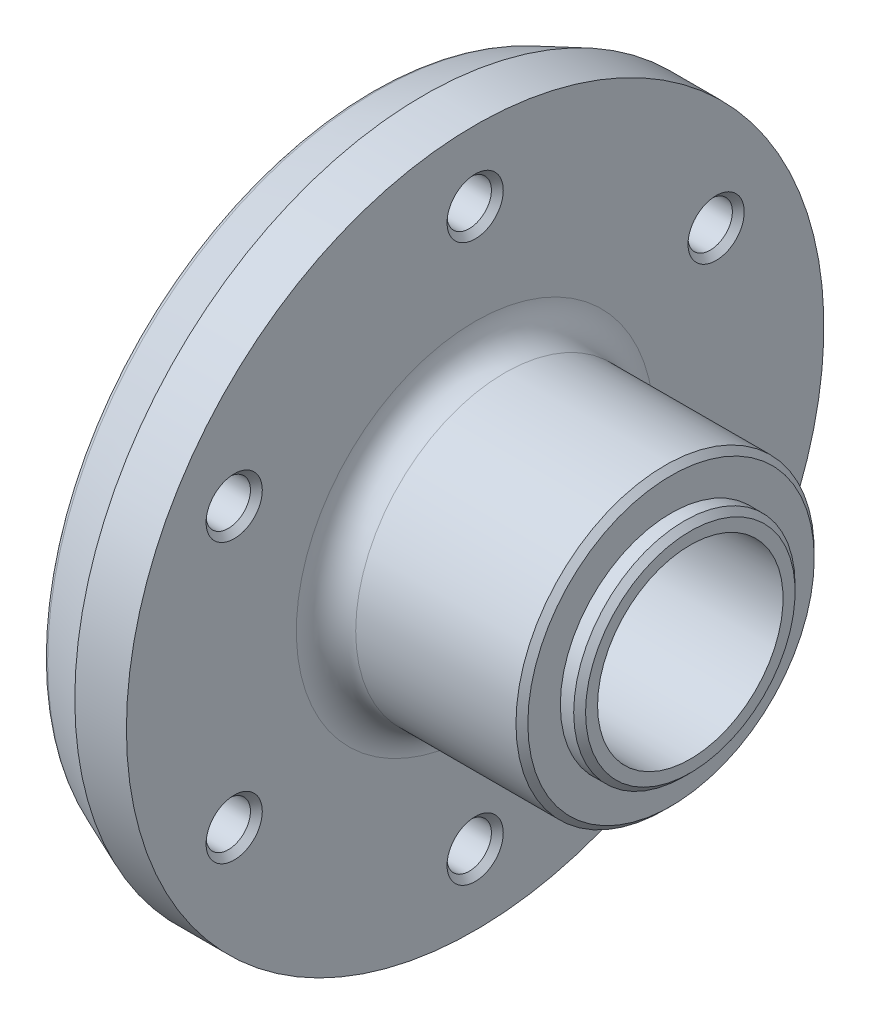
ISO-10303-21;
HEADER;
FILE_DESCRIPTION(('STEP AP214'),'2;1');
FILE_NAME('part.step','',(''),(''),'','','');
FILE_SCHEMA(('AUTOMOTIVE_DESIGN { 1 0 10303 214 1 1 1 1 }'));
ENDSEC;
DATA;
#1=APPLICATION_CONTEXT('core data for automotive mechanical design processes');
#2=APPLICATION_PROTOCOL_DEFINITION('international standard','automotive_design',2000,#1);
#3=PRODUCT_CONTEXT('',#1,'mechanical');
#4=PRODUCT('Part','Part','',(#3));
#5=PRODUCT_RELATED_PRODUCT_CATEGORY('part','',(#4));
#6=PRODUCT_DEFINITION_FORMATION('','',#4);
#7=PRODUCT_DEFINITION_CONTEXT('part definition',#1,'design');
#8=PRODUCT_DEFINITION('design','',#6,#7);
#9=PRODUCT_DEFINITION_SHAPE('','',#8);
#10=(LENGTH_UNIT() NAMED_UNIT(*) SI_UNIT(.MILLI.,.METRE.));
#11=(NAMED_UNIT(*) PLANE_ANGLE_UNIT() SI_UNIT($,.RADIAN.));
#12=(NAMED_UNIT(*) SI_UNIT($,.STERADIAN.) SOLID_ANGLE_UNIT());
#13=UNCERTAINTY_MEASURE_WITH_UNIT(LENGTH_MEASURE(1.E-05),#10,'distance_accuracy_value','');
#14=(GEOMETRIC_REPRESENTATION_CONTEXT(3) GLOBAL_UNCERTAINTY_ASSIGNED_CONTEXT((#13)) GLOBAL_UNIT_ASSIGNED_CONTEXT((#10,
#11,#12)) REPRESENTATION_CONTEXT('',''));
#15=CARTESIAN_POINT('',(0.,0.,0.));
#16=DIRECTION('',(0.,0.,1.));
#17=DIRECTION('',(1.,0.,0.));
#18=AXIS2_PLACEMENT_3D('',#15,#16,#17);
#19=CARTESIAN_POINT('',(78.54696,-23.8125,0.));
#20=DIRECTION('',(-1.,0.,0.));
#21=DIRECTION('',(0.,0.,1.));
#22=AXIS2_PLACEMENT_3D('',#19,#20,#21);
#23=CYLINDRICAL_SURFACE('',#22,2.413);
#24=CARTESIAN_POINT('',(46.863,-23.8125,0.));
#25=DIRECTION('',(-1.,0.,0.));
#26=DIRECTION('',(0.,0.,1.));
#27=AXIS2_PLACEMENT_3D('',#24,#25,#26);
#28=CIRCLE('',#27,2.413);
#29=CARTESIAN_POINT('',(46.863,-23.8125,2.413));
#30=VERTEX_POINT('',#29);
#31=EDGE_CURVE('P0_E10',#30,#30,#28,.F.);
#32=ORIENTED_EDGE('',*,*,#31,.T.);
#33=EDGE_LOOP('',(#32));
#34=FACE_BOUND('',#33,.T.);
#35=CARTESIAN_POINT('',(55.88,-23.8125,0.));
#36=DIRECTION('',(-1.,0.,0.));
#37=DIRECTION('',(0.,0.,1.));
#38=AXIS2_PLACEMENT_3D('',#35,#36,#37);
#39=CIRCLE('',#38,2.413);
#40=CARTESIAN_POINT('',(55.88,-23.8125,2.413));
#41=VERTEX_POINT('',#40);
#42=EDGE_CURVE('P0_E15',#41,#41,#39,.T.);
#43=ORIENTED_EDGE('',*,*,#42,.T.);
#44=EDGE_LOOP('',(#43));
#45=FACE_BOUND('',#44,.T.);
#46=ADVANCED_FACE('P0_F14',(#34,#45),#23,.T.);
#47=OPEN_SHELL('',(#46));
#48=SHELL_BASED_SURFACE_MODEL('P0_B1',(#47));
#49=CARTESIAN_POINT('',(72.1360000003251,0.,0.));
#50=DIRECTION('',(-1.,0.,0.));
#51=DIRECTION('',(0.,0.,1.));
#52=AXIS2_PLACEMENT_3D('',#49,#50,#51);
#53=CONICAL_SURFACE('',#52,12.7634999996748,0.785398163397302);
#54=CARTESIAN_POINT('',(72.644,0.,0.));
#55=DIRECTION('',(-1.,0.,0.));
#56=DIRECTION('',(0.,0.,1.));
#57=AXIS2_PLACEMENT_3D('',#54,#55,#56);
#58=CIRCLE('',#57,12.2555);
#59=CARTESIAN_POINT('',(72.644,0.,12.2555));
#60=VERTEX_POINT('',#59);
#61=EDGE_CURVE('P1_E107',#60,#60,#58,.T.);
#62=ORIENTED_EDGE('',*,*,#61,.T.);
#63=EDGE_LOOP('',(#62));
#64=FACE_BOUND('',#63,.T.);
#65=CARTESIAN_POINT('',(72.1360000003302,0.,0.));
#66=DIRECTION('',(-1.,0.,0.));
#67=DIRECTION('',(0.,0.,1.));
#68=AXIS2_PLACEMENT_3D('',#65,#66,#67);
#69=CIRCLE('',#68,12.7635);
#70=CARTESIAN_POINT('',(72.1360000003302,0.,12.7635));
#71=VERTEX_POINT('',#70);
#72=EDGE_CURVE('P1_E108',#71,#71,#69,.T.);
#73=ORIENTED_EDGE('',*,*,#72,.F.);
#74=EDGE_LOOP('',(#73));
#75=FACE_BOUND('',#74,.T.);
#76=ADVANCED_FACE('P1_F16',(#64,#75),#53,.T.);
#77=CARTESIAN_POINT('',(75.6666,0.,0.));
#78=DIRECTION('',(-1.,0.,0.));
#79=DIRECTION('',(0.,0.,1.));
#80=AXIS2_PLACEMENT_3D('',#77,#78,#79);
#81=CYLINDRICAL_SURFACE('',#80,12.7635);
#82=CARTESIAN_POINT('',(58.42,0.,0.));
#83=DIRECTION('',(-1.,0.,0.));
#84=DIRECTION('',(0.,-0.99988463643586,0.0151892665895294));
#85=AXIS2_PLACEMENT_3D('',#82,#83,#84);
#86=CIRCLE('',#85,12.7635);
#87=CARTESIAN_POINT('',(58.42,-12.7620275571491,0.193868204115458));
#88=VERTEX_POINT('',#87);
#89=EDGE_CURVE('P1_E99',#88,#88,#86,.F.);
#90=ORIENTED_EDGE('',*,*,#89,.T.);
#91=EDGE_LOOP('',(#90));
#92=FACE_BOUND('',#91,.T.);
#93=ORIENTED_EDGE('',*,*,#72,.T.);
#94=EDGE_LOOP('',(#93));
#95=FACE_BOUND('',#94,.T.);
#96=ADVANCED_FACE('P1_F597',(#92,#95),#81,.T.);
#97=CARTESIAN_POINT('',(72.644,0.,0.));
#98=DIRECTION('',(-1.,0.,0.));
#99=DIRECTION('',(0.,0.,1.));
#100=AXIS2_PLACEMENT_3D('',#97,#98,#99);
#101=PLANE('',#100);
#102=CARTESIAN_POINT('',(72.644,0.,0.));
#103=DIRECTION('',(-1.,0.,0.));
#104=DIRECTION('',(0.,0.,1.));
#105=AXIS2_PLACEMENT_3D('',#102,#103,#104);
#106=CIRCLE('',#105,9.4742);
#107=CARTESIAN_POINT('',(72.644,0.,9.4742));
#108=VERTEX_POINT('',#107);
#109=EDGE_CURVE('P1_E56',#108,#108,#106,.F.);
#110=ORIENTED_EDGE('',*,*,#109,.F.);
#111=EDGE_LOOP('',(#110));
#112=FACE_BOUND('',#111,.T.);
#113=ORIENTED_EDGE('',*,*,#61,.F.);
#114=EDGE_LOOP('',(#113));
#115=FACE_BOUND('',#114,.T.);
#116=ADVANCED_FACE('P1_F91',(#112,#115),#101,.F.);
#117=CARTESIAN_POINT('',(58.42,0.,0.));
#118=DIRECTION('',(-1.,0.,0.));
#119=DIRECTION('',(0.,-0.99988463643586,0.0151892665895294));
#120=AXIS2_PLACEMENT_3D('',#117,#118,#119);
#121=TOROIDAL_SURFACE('',#120,15.3035,2.54);
#122=ORIENTED_EDGE('',*,*,#89,.F.);
#123=EDGE_LOOP('',(#122));
#124=FACE_BOUND('',#123,.T.);
#125=CARTESIAN_POINT('',(55.88,0.,0.));
#126=DIRECTION('',(1.,0.,0.));
#127=DIRECTION('',(0.,1.,0.));
#128=AXIS2_PLACEMENT_3D('',#125,#126,#127);
#129=CIRCLE('',#128,15.3035);
#130=CARTESIAN_POINT('',(55.88,15.3035,0.));
#131=VERTEX_POINT('',#130);
#132=CARTESIAN_POINT('',(55.88,-15.3035,0.));
#133=VERTEX_POINT('',#132);
#134=EDGE_CURVE('P1_E51',#131,#133,#129,.T.);
#135=ORIENTED_EDGE('',*,*,#134,.T.);
#136=CARTESIAN_POINT('',(55.88,0.,0.));
#137=DIRECTION('',(1.,0.,0.));
#138=DIRECTION('',(0.,-1.,0.));
#139=AXIS2_PLACEMENT_3D('',#136,#137,#138);
#140=CIRCLE('',#139,15.3035);
#141=EDGE_CURVE('P1_E48',#133,#131,#140,.T.);
#142=ORIENTED_EDGE('',*,*,#141,.T.);
#143=EDGE_LOOP('',(#135,#142));
#144=FACE_BOUND('',#143,.T.);
#145=ADVANCED_FACE('P1_F52',(#124,#144),#121,.F.);
#146=CARTESIAN_POINT('',(75.6666,0.,0.));
#147=DIRECTION('',(-1.,0.,0.));
#148=DIRECTION('',(0.,0.,1.));
#149=AXIS2_PLACEMENT_3D('',#146,#147,#148);
#150=CYLINDRICAL_SURFACE('',#149,9.4742);
#151=ORIENTED_EDGE('',*,*,#109,.T.);
#152=EDGE_LOOP('',(#151));
#153=FACE_BOUND('',#152,.T.);
#154=CARTESIAN_POINT('',(73.7869999999949,0.,0.));
#155=DIRECTION('',(-1.,0.,0.));
#156=DIRECTION('',(0.,0.,-1.));
#157=AXIS2_PLACEMENT_3D('',#154,#155,#156);
#158=CIRCLE('',#157,9.47419999999489);
#159=CARTESIAN_POINT('',(73.7869999999949,0.,-9.47419999999489));
#160=VERTEX_POINT('',#159);
#161=EDGE_CURVE('P1_E62',#160,#160,#158,.F.);
#162=ORIENTED_EDGE('',*,*,#161,.F.);
#163=EDGE_LOOP('',(#162));
#164=FACE_BOUND('',#163,.T.);
#165=ADVANCED_FACE('P1_F82',(#153,#164),#150,.T.);
#166=CARTESIAN_POINT('',(55.88,0.,0.));
#167=DIRECTION('',(-1.,0.,0.));
#168=DIRECTION('',(0.,0.,1.));
#169=AXIS2_PLACEMENT_3D('',#166,#167,#168);
#170=PLANE('',#169);
#171=CARTESIAN_POINT('',(55.8799999999451,-11.90625,20.6222299276167));
#172=DIRECTION('',(1.,0.,0.));
#173=DIRECTION('',(0.,0.,-1.));
#174=AXIS2_PLACEMENT_3D('',#171,#172,#173);
#175=CIRCLE('',#174,2.4066499999751);
#176=CARTESIAN_POINT('',(55.8799999999451,-11.90625,18.2155799276416));
#177=VERTEX_POINT('',#176);
#178=EDGE_CURVE('P1_E155',#177,#177,#175,.F.);
#179=ORIENTED_EDGE('',*,*,#178,.T.);
#180=EDGE_LOOP('',(#179));
#181=FACE_BOUND('',#180,.T.);
#182=CARTESIAN_POINT('',(55.8799999999451,11.90625,20.6222299276167));
#183=DIRECTION('',(1.,0.,0.));
#184=DIRECTION('',(0.,0.,-1.));
#185=AXIS2_PLACEMENT_3D('',#182,#183,#184);
#186=CIRCLE('',#185,2.4066499999751);
#187=CARTESIAN_POINT('',(55.8799999999451,11.90625,18.2155799276416));
#188=VERTEX_POINT('',#187);
#189=EDGE_CURVE('P1_E152',#188,#188,#186,.F.);
#190=ORIENTED_EDGE('',*,*,#189,.T.);
#191=EDGE_LOOP('',(#190));
#192=FACE_BOUND('',#191,.T.);
#193=CARTESIAN_POINT('',(55.8800000000019,23.8125,0.));
#194=DIRECTION('',(1.,0.,0.));
#195=DIRECTION('',(0.,0.,-1.));
#196=AXIS2_PLACEMENT_3D('',#193,#194,#195);
#197=CIRCLE('',#196,2.40664999995488);
#198=CARTESIAN_POINT('',(55.8800000000019,23.8125,-2.40664999995488));
#199=VERTEX_POINT('',#198);
#200=EDGE_CURVE('P1_E148',#199,#199,#197,.F.);
#201=ORIENTED_EDGE('',*,*,#200,.T.);
#202=EDGE_LOOP('',(#201));
#203=FACE_BOUND('',#202,.T.);
#204=CARTESIAN_POINT('',(55.8799999999451,11.90625,-20.6222299276167));
#205=DIRECTION('',(1.,0.,0.));
#206=DIRECTION('',(0.,0.,-1.));
#207=AXIS2_PLACEMENT_3D('',#204,#205,#206);
#208=CIRCLE('',#207,2.4066499999915);
#209=CARTESIAN_POINT('',(55.8799999999451,11.90625,-23.0288799276082));
#210=VERTEX_POINT('',#209);
#211=EDGE_CURVE('P1_E145',#210,#210,#208,.F.);
#212=ORIENTED_EDGE('',*,*,#211,.T.);
#213=EDGE_LOOP('',(#212));
#214=FACE_BOUND('',#213,.T.);
#215=CARTESIAN_POINT('',(55.8799999999451,-11.90625,-20.6222299276167));
#216=DIRECTION('',(1.,0.,0.));
#217=DIRECTION('',(0.,0.,-1.));
#218=AXIS2_PLACEMENT_3D('',#215,#216,#217);
#219=CIRCLE('',#218,2.4066499999915);
#220=CARTESIAN_POINT('',(55.8799999999451,-11.90625,-23.0288799276082));
#221=VERTEX_POINT('',#220);
#222=EDGE_CURVE('P1_E142',#221,#221,#219,.F.);
#223=ORIENTED_EDGE('',*,*,#222,.T.);
#224=EDGE_LOOP('',(#223));
#225=FACE_BOUND('',#224,.T.);
#226=CARTESIAN_POINT('',(55.8800000000019,-23.8125,0.));
#227=DIRECTION('',(1.,0.,0.));
#228=DIRECTION('',(0.,0.,-1.));
#229=AXIS2_PLACEMENT_3D('',#226,#227,#228);
#230=CIRCLE('',#229,2.40664999995488);
#231=CARTESIAN_POINT('',(55.8800000000019,-23.8125,-2.40664999995488));
#232=VERTEX_POINT('',#231);
#233=EDGE_CURVE('P1_E139',#232,#232,#230,.F.);
#234=ORIENTED_EDGE('',*,*,#233,.T.);
#235=EDGE_LOOP('',(#234));
#236=FACE_BOUND('',#235,.T.);
#237=ORIENTED_EDGE('',*,*,#134,.F.);
#238=ORIENTED_EDGE('',*,*,#141,.F.);
#239=EDGE_LOOP('',(#237,#238));
#240=FACE_BOUND('',#239,.T.);
#241=CARTESIAN_POINT('',(55.88,0.,0.));
#242=DIRECTION('',(-1.,0.,0.));
#243=DIRECTION('',(0.,0.,1.));
#244=AXIS2_PLACEMENT_3D('',#241,#242,#243);
#245=CIRCLE('',#244,29.845);
#246=CARTESIAN_POINT('',(55.88,0.,29.845));
#247=VERTEX_POINT('',#246);
#248=EDGE_CURVE('P1_E158',#247,#247,#245,.T.);
#249=ORIENTED_EDGE('',*,*,#248,.F.);
#250=EDGE_LOOP('',(#249));
#251=FACE_BOUND('',#250,.T.);
#252=ADVANCED_FACE('P1_F59',(#181,#192,#203,#214,#225,#236,#240,#251),#170,.F.);
#253=CARTESIAN_POINT('',(73.7869999999949,0.,0.));
#254=DIRECTION('',(-1.,0.,0.));
#255=DIRECTION('',(0.,0.,1.));
#256=AXIS2_PLACEMENT_3D('',#253,#254,#255);
#257=CONICAL_SURFACE('',#256,9.47419999999488,0.785398163397298);
#258=CARTESIAN_POINT('',(74.2949999999949,0.,0.));
#259=DIRECTION('',(-1.,0.,0.));
#260=DIRECTION('',(0.,0.,1.));
#261=AXIS2_PLACEMENT_3D('',#258,#259,#260);
#262=CIRCLE('',#261,8.96619999999497);
#263=CARTESIAN_POINT('',(74.2949999999949,0.,8.96619999999497));
#264=VERTEX_POINT('',#263);
#265=EDGE_CURVE('P1_E135',#264,#264,#262,.T.);
#266=ORIENTED_EDGE('',*,*,#265,.T.);
#267=EDGE_LOOP('',(#266));
#268=FACE_BOUND('',#267,.T.);
#269=ORIENTED_EDGE('',*,*,#161,.T.);
#270=EDGE_LOOP('',(#269));
#271=FACE_BOUND('',#270,.T.);
#272=ADVANCED_FACE('P1_F81',(#268,#271),#257,.T.);
#273=CARTESIAN_POINT('',(75.6666,0.,0.));
#274=DIRECTION('',(-1.,0.,0.));
#275=DIRECTION('',(0.,0.,1.));
#276=AXIS2_PLACEMENT_3D('',#273,#274,#275);
#277=CYLINDRICAL_SURFACE('',#276,29.845);
#278=ORIENTED_EDGE('',*,*,#248,.T.);
#279=EDGE_LOOP('',(#278));
#280=FACE_BOUND('',#279,.T.);
#281=CARTESIAN_POINT('',(51.4620768363209,0.,0.));
#282=DIRECTION('',(1.,0.,0.));
#283=DIRECTION('',(0.,-1.,0.));
#284=AXIS2_PLACEMENT_3D('',#281,#282,#283);
#285=CIRCLE('',#284,29.8450000000007);
#286=CARTESIAN_POINT('',(51.4620768363209,-29.8450000000007,0.));
#287=VERTEX_POINT('',#286);
#288=EDGE_CURVE('P1_E138',#287,#287,#285,.F.);
#289=ORIENTED_EDGE('',*,*,#288,.F.);
#290=EDGE_LOOP('',(#289));
#291=FACE_BOUND('',#290,.T.);
#292=ADVANCED_FACE('P1_F256',(#280,#291),#277,.T.);
#293=CARTESIAN_POINT('',(55.8799999999451,-11.90625,20.6222299276167));
#294=DIRECTION('',(1.,0.,0.));
#295=DIRECTION('',(0.,0.,-1.));
#296=AXIS2_PLACEMENT_3D('',#293,#294,#295);
#297=CONICAL_SURFACE('',#296,2.4066499999751,0.785398163397448);
#298=CARTESIAN_POINT('',(55.372,-11.90625,20.6222299276167));
#299=DIRECTION('',(-1.,0.,0.));
#300=DIRECTION('',(0.,0.,1.));
#301=AXIS2_PLACEMENT_3D('',#298,#299,#300);
#302=CIRCLE('',#301,1.89865);
#303=CARTESIAN_POINT('',(55.372,-11.90625,22.5208799276167));
#304=VERTEX_POINT('',#303);
#305=EDGE_CURVE('P1_E244',#304,#304,#302,.T.);
#306=ORIENTED_EDGE('',*,*,#305,.T.);
#307=EDGE_LOOP('',(#306));
#308=FACE_BOUND('',#307,.T.);
#309=ORIENTED_EDGE('',*,*,#178,.F.);
#310=EDGE_LOOP('',(#309));
#311=FACE_BOUND('',#310,.T.);
#312=ADVANCED_FACE('P1_F258',(#308,#311),#297,.F.);
#313=CARTESIAN_POINT('',(55.8799999999451,11.90625,20.6222299276167));
#314=DIRECTION('',(1.,0.,0.));
#315=DIRECTION('',(0.,0.,-1.));
#316=AXIS2_PLACEMENT_3D('',#313,#314,#315);
#317=CONICAL_SURFACE('',#316,2.4066499999751,0.785398163397448);
#318=CARTESIAN_POINT('',(55.372,11.90625,20.6222299276167));
#319=DIRECTION('',(-1.,0.,0.));
#320=DIRECTION('',(0.,0.,1.));
#321=AXIS2_PLACEMENT_3D('',#318,#319,#320);
#322=CIRCLE('',#321,1.89865);
#323=CARTESIAN_POINT('',(55.372,11.90625,22.5208799276167));
#324=VERTEX_POINT('',#323);
#325=EDGE_CURVE('P1_E241',#324,#324,#322,.T.);
#326=ORIENTED_EDGE('',*,*,#325,.T.);
#327=EDGE_LOOP('',(#326));
#328=FACE_BOUND('',#327,.T.);
#329=ORIENTED_EDGE('',*,*,#189,.F.);
#330=EDGE_LOOP('',(#329));
#331=FACE_BOUND('',#330,.T.);
#332=ADVANCED_FACE('P1_F265',(#328,#331),#317,.F.);
#333=CARTESIAN_POINT('',(55.8800000000019,23.8125,0.));
#334=DIRECTION('',(1.,0.,0.));
#335=DIRECTION('',(0.,0.,-1.));
#336=AXIS2_PLACEMENT_3D('',#333,#334,#335);
#337=CONICAL_SURFACE('',#336,2.40664999995488,0.785398163397448);
#338=CARTESIAN_POINT('',(55.372,23.8125,0.));
#339=DIRECTION('',(-1.,0.,0.));
#340=DIRECTION('',(0.,0.,1.));
#341=AXIS2_PLACEMENT_3D('',#338,#339,#340);
#342=CIRCLE('',#341,1.89865);
#343=CARTESIAN_POINT('',(55.372,23.8125,1.89865));
#344=VERTEX_POINT('',#343);
#345=EDGE_CURVE('P1_E237',#344,#344,#342,.T.);
#346=ORIENTED_EDGE('',*,*,#345,.T.);
#347=EDGE_LOOP('',(#346));
#348=FACE_BOUND('',#347,.T.);
#349=ORIENTED_EDGE('',*,*,#200,.F.);
#350=EDGE_LOOP('',(#349));
#351=FACE_BOUND('',#350,.T.);
#352=ADVANCED_FACE('P1_F335',(#348,#351),#337,.F.);
#353=CARTESIAN_POINT('',(55.8799999999451,11.90625,-20.6222299276167));
#354=DIRECTION('',(1.,0.,0.));
#355=DIRECTION('',(0.,0.,-1.));
#356=AXIS2_PLACEMENT_3D('',#353,#354,#355);
#357=CONICAL_SURFACE('',#356,2.4066499999915,0.785398163397448);
#358=CARTESIAN_POINT('',(55.372,11.90625,-20.6222299276167));
#359=DIRECTION('',(-1.,0.,0.));
#360=DIRECTION('',(0.,0.,1.));
#361=AXIS2_PLACEMENT_3D('',#358,#359,#360);
#362=CIRCLE('',#361,1.89865);
#363=CARTESIAN_POINT('',(55.372,11.90625,-18.7235799276167));
#364=VERTEX_POINT('',#363);
#365=EDGE_CURVE('P1_E234',#364,#364,#362,.T.);
#366=ORIENTED_EDGE('',*,*,#365,.T.);
#367=EDGE_LOOP('',(#366));
#368=FACE_BOUND('',#367,.T.);
#369=ORIENTED_EDGE('',*,*,#211,.F.);
#370=EDGE_LOOP('',(#369));
#371=FACE_BOUND('',#370,.T.);
#372=ADVANCED_FACE('P1_F360',(#368,#371),#357,.F.);
#373=CARTESIAN_POINT('',(55.8799999999451,-11.90625,-20.6222299276167));
#374=DIRECTION('',(1.,0.,0.));
#375=DIRECTION('',(0.,0.,-1.));
#376=AXIS2_PLACEMENT_3D('',#373,#374,#375);
#377=CONICAL_SURFACE('',#376,2.4066499999915,0.785398163397448);
#378=CARTESIAN_POINT('',(55.372,-11.90625,-20.6222299276167));
#379=DIRECTION('',(-1.,0.,0.));
#380=DIRECTION('',(0.,0.,1.));
#381=AXIS2_PLACEMENT_3D('',#378,#379,#380);
#382=CIRCLE('',#381,1.89865);
#383=CARTESIAN_POINT('',(55.372,-11.90625,-18.7235799276167));
#384=VERTEX_POINT('',#383);
#385=EDGE_CURVE('P1_E231',#384,#384,#382,.T.);
#386=ORIENTED_EDGE('',*,*,#385,.T.);
#387=EDGE_LOOP('',(#386));
#388=FACE_BOUND('',#387,.T.);
#389=ORIENTED_EDGE('',*,*,#222,.F.);
#390=EDGE_LOOP('',(#389));
#391=FACE_BOUND('',#390,.T.);
#392=ADVANCED_FACE('P1_F351',(#388,#391),#377,.F.);
#393=CARTESIAN_POINT('',(55.8800000000019,-23.8125,0.));
#394=DIRECTION('',(1.,0.,0.));
#395=DIRECTION('',(0.,0.,-1.));
#396=AXIS2_PLACEMENT_3D('',#393,#394,#395);
#397=CONICAL_SURFACE('',#396,2.40664999995488,0.785398163397448);
#398=CARTESIAN_POINT('',(55.372,-23.8125,0.));
#399=DIRECTION('',(-1.,0.,0.));
#400=DIRECTION('',(0.,0.,1.));
#401=AXIS2_PLACEMENT_3D('',#398,#399,#400);
#402=CIRCLE('',#401,1.89865);
#403=CARTESIAN_POINT('',(55.372,-23.8125,1.89865));
#404=VERTEX_POINT('',#403);
#405=EDGE_CURVE('P1_E134',#404,#404,#402,.T.);
#406=ORIENTED_EDGE('',*,*,#405,.T.);
#407=EDGE_LOOP('',(#406));
#408=FACE_BOUND('',#407,.T.);
#409=ORIENTED_EDGE('',*,*,#233,.F.);
#410=EDGE_LOOP('',(#409));
#411=FACE_BOUND('',#410,.T.);
#412=ADVANCED_FACE('P1_F348',(#408,#411),#397,.F.);
#413=CARTESIAN_POINT('',(74.295,0.,0.));
#414=DIRECTION('',(-1.,0.,0.));
#415=DIRECTION('',(0.,0.,1.));
#416=AXIS2_PLACEMENT_3D('',#413,#414,#415);
#417=PLANE('',#416);
#418=CARTESIAN_POINT('',(74.295,0.,0.));
#419=DIRECTION('',(-1.,0.,0.));
#420=DIRECTION('',(0.,0.,1.));
#421=AXIS2_PLACEMENT_3D('',#418,#419,#420);
#422=CIRCLE('',#421,7.9375);
#423=CARTESIAN_POINT('',(74.295,0.,7.9375));
#424=VERTEX_POINT('',#423);
#425=EDGE_CURVE('P1_E130',#424,#424,#422,.T.);
#426=ORIENTED_EDGE('',*,*,#425,.T.);
#427=EDGE_LOOP('',(#426));
#428=FACE_BOUND('',#427,.T.);
#429=ORIENTED_EDGE('',*,*,#265,.F.);
#430=EDGE_LOOP('',(#429));
#431=FACE_BOUND('',#430,.T.);
#432=ADVANCED_FACE('P1_F350',(#428,#431),#417,.F.);
#433=CARTESIAN_POINT('',(51.4620768363209,0.,0.));
#434=DIRECTION('',(1.,0.,0.));
#435=DIRECTION('',(0.,0.,-1.));
#436=AXIS2_PLACEMENT_3D('',#433,#434,#435);
#437=CONICAL_SURFACE('',#436,29.8450000000007,0.39269908169865);
#438=ORIENTED_EDGE('',*,*,#288,.T.);
#439=EDGE_LOOP('',(#438));
#440=FACE_BOUND('',#439,.T.);
#441=CARTESIAN_POINT('',(47.4901936327134,0.,0.));
#442=DIRECTION('',(-1.,0.,0.));
#443=DIRECTION('',(0.,-0.999988843472748,-0.00472365642663322));
#444=AXIS2_PLACEMENT_3D('',#441,#442,#443);
#445=CIRCLE('',#444,28.1997921088981);
#446=CARTESIAN_POINT('',(47.4901936327134,-28.199477497149,-0.133206129224918));
#447=VERTEX_POINT('',#446);
#448=EDGE_CURVE('P1_E133',#447,#447,#445,.T.);
#449=ORIENTED_EDGE('',*,*,#448,.F.);
#450=EDGE_LOOP('',(#449));
#451=FACE_BOUND('',#450,.T.);
#452=ADVANCED_FACE('P1_F253',(#440,#451),#437,.T.);
#453=CARTESIAN_POINT('',(78.54696,-11.90625,20.6222299276167));
#454=DIRECTION('',(-1.,0.,0.));
#455=DIRECTION('',(0.,0.,1.));
#456=AXIS2_PLACEMENT_3D('',#453,#454,#455);
#457=CYLINDRICAL_SURFACE('',#456,1.89865);
#458=CARTESIAN_POINT('',(47.3710000074448,-11.90625,20.6222299276167));
#459=DIRECTION('',(-1.,0.,0.));
#460=DIRECTION('',(0.,0.,-1.));
#461=AXIS2_PLACEMENT_3D('',#458,#459,#460);
#462=CIRCLE('',#461,1.89864999256064);
#463=CARTESIAN_POINT('',(47.3710000074448,-11.90625,18.723579935056));
#464=VERTEX_POINT('',#463);
#465=EDGE_CURVE('P1_E223',#464,#464,#462,.T.);
#466=ORIENTED_EDGE('',*,*,#465,.T.);
#467=EDGE_LOOP('',(#466));
#468=FACE_BOUND('',#467,.T.);
#469=ORIENTED_EDGE('',*,*,#305,.F.);
#470=EDGE_LOOP('',(#469));
#471=FACE_BOUND('',#470,.T.);
#472=ADVANCED_FACE('P1_F329',(#468,#471),#457,.F.);
#473=CARTESIAN_POINT('',(78.54696,11.90625,20.6222299276167));
#474=DIRECTION('',(-1.,0.,0.));
#475=DIRECTION('',(0.,0.,1.));
#476=AXIS2_PLACEMENT_3D('',#473,#474,#475);
#477=CYLINDRICAL_SURFACE('',#476,1.89865);
#478=CARTESIAN_POINT('',(47.3710000074448,11.90625,20.6222299276167));
#479=DIRECTION('',(-1.,0.,0.));
#480=DIRECTION('',(0.,0.,-1.));
#481=AXIS2_PLACEMENT_3D('',#478,#479,#480);
#482=CIRCLE('',#481,1.89864999256064);
#483=CARTESIAN_POINT('',(47.3710000074448,11.90625,18.723579935056));
#484=VERTEX_POINT('',#483);
#485=EDGE_CURVE('P1_E219',#484,#484,#482,.T.);
#486=ORIENTED_EDGE('',*,*,#485,.T.);
#487=EDGE_LOOP('',(#486));
#488=FACE_BOUND('',#487,.T.);
#489=ORIENTED_EDGE('',*,*,#325,.F.);
#490=EDGE_LOOP('',(#489));
#491=FACE_BOUND('',#490,.T.);
#492=ADVANCED_FACE('P1_F325',(#488,#491),#477,.F.);
#493=CARTESIAN_POINT('',(78.54696,23.8125,0.));
#494=DIRECTION('',(-1.,0.,0.));
#495=DIRECTION('',(0.,0.,1.));
#496=AXIS2_PLACEMENT_3D('',#493,#494,#495);
#497=CYLINDRICAL_SURFACE('',#496,1.89865);
#498=CARTESIAN_POINT('',(47.3710000073879,23.8125,0.));
#499=DIRECTION('',(-1.,0.,0.));
#500=DIRECTION('',(0.,0.,-1.));
#501=AXIS2_PLACEMENT_3D('',#498,#499,#500);
#502=CIRCLE('',#501,1.89864999248357);
#503=CARTESIAN_POINT('',(47.3710000073879,23.8125,-1.89864999248357));
#504=VERTEX_POINT('',#503);
#505=EDGE_CURVE('P1_E215',#504,#504,#502,.T.);
#506=ORIENTED_EDGE('',*,*,#505,.T.);
#507=EDGE_LOOP('',(#506));
#508=FACE_BOUND('',#507,.T.);
#509=ORIENTED_EDGE('',*,*,#345,.F.);
#510=EDGE_LOOP('',(#509));
#511=FACE_BOUND('',#510,.T.);
#512=ADVANCED_FACE('P1_F328',(#508,#511),#497,.F.);
#513=CARTESIAN_POINT('',(78.54696,11.90625,-20.6222299276167));
#514=DIRECTION('',(-1.,0.,0.));
#515=DIRECTION('',(0.,0.,1.));
#516=AXIS2_PLACEMENT_3D('',#513,#514,#515);
#517=CYLINDRICAL_SURFACE('',#516,1.89865);
#518=CARTESIAN_POINT('',(47.3710000073879,11.90625,-20.6222299276167));
#519=DIRECTION('',(-1.,0.,0.));
#520=DIRECTION('',(0.,0.,-1.));
#521=AXIS2_PLACEMENT_3D('',#518,#519,#520);
#522=CIRCLE('',#521,1.89864999257703);
#523=CARTESIAN_POINT('',(47.3710000073879,11.90625,-22.5208799201937));
#524=VERTEX_POINT('',#523);
#525=EDGE_CURVE('P1_E212',#524,#524,#522,.T.);
#526=ORIENTED_EDGE('',*,*,#525,.T.);
#527=EDGE_LOOP('',(#526));
#528=FACE_BOUND('',#527,.T.);
#529=ORIENTED_EDGE('',*,*,#365,.F.);
#530=EDGE_LOOP('',(#529));
#531=FACE_BOUND('',#530,.T.);
#532=ADVANCED_FACE('P1_F376',(#528,#531),#517,.F.);
#533=CARTESIAN_POINT('',(78.54696,-11.90625,-20.6222299276167));
#534=DIRECTION('',(-1.,0.,0.));
#535=DIRECTION('',(0.,0.,1.));
#536=AXIS2_PLACEMENT_3D('',#533,#534,#535);
#537=CYLINDRICAL_SURFACE('',#536,1.89865);
#538=CARTESIAN_POINT('',(47.3710000073879,-11.90625,-20.6222299276167));
#539=DIRECTION('',(-1.,0.,0.));
#540=DIRECTION('',(0.,0.,-1.));
#541=AXIS2_PLACEMENT_3D('',#538,#539,#540);
#542=CIRCLE('',#541,1.89864999257703);
#543=CARTESIAN_POINT('',(47.3710000073879,-11.90625,-22.5208799201937));
#544=VERTEX_POINT('',#543);
#545=EDGE_CURVE('P1_E209',#544,#544,#542,.T.);
#546=ORIENTED_EDGE('',*,*,#545,.T.);
#547=EDGE_LOOP('',(#546));
#548=FACE_BOUND('',#547,.T.);
#549=ORIENTED_EDGE('',*,*,#385,.F.);
#550=EDGE_LOOP('',(#549));
#551=FACE_BOUND('',#550,.T.);
#552=ADVANCED_FACE('P1_F382',(#548,#551),#537,.F.);
#553=CARTESIAN_POINT('',(78.54696,-23.8125,0.));
#554=DIRECTION('',(-1.,0.,0.));
#555=DIRECTION('',(0.,0.,1.));
#556=AXIS2_PLACEMENT_3D('',#553,#554,#555);
#557=CYLINDRICAL_SURFACE('',#556,1.89865);
#558=CARTESIAN_POINT('',(47.3710000073879,-23.8125,0.));
#559=DIRECTION('',(-1.,0.,0.));
#560=DIRECTION('',(0.,0.,-1.));
#561=AXIS2_PLACEMENT_3D('',#558,#559,#560);
#562=CIRCLE('',#561,1.89864999248357);
#563=CARTESIAN_POINT('',(47.3710000073879,-23.8125,-1.89864999248357));
#564=VERTEX_POINT('',#563);
#565=EDGE_CURVE('P1_E206',#564,#564,#562,.T.);
#566=ORIENTED_EDGE('',*,*,#565,.T.);
#567=EDGE_LOOP('',(#566));
#568=FACE_BOUND('',#567,.T.);
#569=ORIENTED_EDGE('',*,*,#405,.F.);
#570=EDGE_LOOP('',(#569));
#571=FACE_BOUND('',#570,.T.);
#572=ADVANCED_FACE('P1_F426',(#568,#571),#557,.F.);
#573=CARTESIAN_POINT('',(75.6666,0.,0.));
#574=DIRECTION('',(-1.,0.,0.));
#575=DIRECTION('',(0.,0.,1.));
#576=AXIS2_PLACEMENT_3D('',#573,#574,#575);
#577=CYLINDRICAL_SURFACE('',#576,7.9375);
#578=ORIENTED_EDGE('',*,*,#425,.F.);
#579=EDGE_LOOP('',(#578));
#580=FACE_BOUND('',#579,.T.);
#581=CARTESIAN_POINT('',(47.6249999999996,0.,0.));
#582=DIRECTION('',(-1.,0.,0.));
#583=DIRECTION('',(0.,0.,-1.));
#584=AXIS2_PLACEMENT_3D('',#581,#582,#583);
#585=CIRCLE('',#584,7.93749999999879);
#586=CARTESIAN_POINT('',(47.6249999999996,0.,-7.93749999999879));
#587=VERTEX_POINT('',#586);
#588=EDGE_CURVE('P1_E197',#587,#587,#585,.T.);
#589=ORIENTED_EDGE('',*,*,#588,.T.);
#590=EDGE_LOOP('',(#589));
#591=FACE_BOUND('',#590,.T.);
#592=ADVANCED_FACE('P1_F182',(#580,#591),#577,.F.);
#593=CARTESIAN_POINT('',(47.879,0.,0.));
#594=DIRECTION('',(-1.,0.,0.));
#595=DIRECTION('',(0.,-0.999988843472748,-0.00472365642663322));
#596=AXIS2_PLACEMENT_3D('',#593,#594,#595);
#597=TOROIDAL_SURFACE('',#596,27.2611305038682,1.016);
#598=ORIENTED_EDGE('',*,*,#448,.T.);
#599=EDGE_LOOP('',(#598));
#600=FACE_BOUND('',#599,.T.);
#601=CARTESIAN_POINT('',(46.863,0.,0.));
#602=DIRECTION('',(1.,0.,0.));
#603=DIRECTION('',(0.,1.,0.));
#604=AXIS2_PLACEMENT_3D('',#601,#602,#603);
#605=CIRCLE('',#604,27.2611305038682);
#606=CARTESIAN_POINT('',(46.863,-27.2611305038682,0.));
#607=VERTEX_POINT('',#606);
#608=CARTESIAN_POINT('',(46.863,27.2611305038682,0.));
#609=VERTEX_POINT('',#608);
#610=EDGE_CURVE('P1_E36',#607,#609,#605,.F.);
#611=ORIENTED_EDGE('',*,*,#610,.F.);
#612=CARTESIAN_POINT('',(46.863,0.,0.));
#613=DIRECTION('',(1.,0.,0.));
#614=DIRECTION('',(0.,-1.,0.));
#615=AXIS2_PLACEMENT_3D('',#612,#613,#614);
#616=CIRCLE('',#615,27.2611305038682);
#617=EDGE_CURVE('P1_E166',#609,#607,#616,.F.);
#618=ORIENTED_EDGE('',*,*,#617,.F.);
#619=EDGE_LOOP('',(#611,#618));
#620=FACE_BOUND('',#619,.T.);
#621=ADVANCED_FACE('P1_F170',(#600,#620),#597,.T.);
#622=CARTESIAN_POINT('',(46.8629999999735,-11.90625,20.6222299276167));
#623=DIRECTION('',(-1.,0.,0.));
#624=DIRECTION('',(0.,0.,1.));
#625=AXIS2_PLACEMENT_3D('',#622,#623,#624);
#626=CONICAL_SURFACE('',#625,2.40665000003195,0.785398163397448);
#627=ORIENTED_EDGE('',*,*,#465,.F.);
#628=EDGE_LOOP('',(#627));
#629=FACE_BOUND('',#628,.T.);
#630=CARTESIAN_POINT('',(46.8629999999735,-11.90625,20.6222299276167));
#631=DIRECTION('',(-1.,0.,0.));
#632=DIRECTION('',(0.,0.,1.));
#633=AXIS2_PLACEMENT_3D('',#630,#631,#632);
#634=CIRCLE('',#633,2.40665000003195);
#635=CARTESIAN_POINT('',(46.8629999999735,-11.90625,23.0288799276486));
#636=VERTEX_POINT('',#635);
#637=EDGE_CURVE('P1_E127',#636,#636,#634,.F.);
#638=ORIENTED_EDGE('',*,*,#637,.F.);
#639=EDGE_LOOP('',(#638));
#640=FACE_BOUND('',#639,.T.);
#641=ADVANCED_FACE('P1_F181',(#629,#640),#626,.F.);
#642=CARTESIAN_POINT('',(46.8629999999735,11.90625,20.6222299276167));
#643=DIRECTION('',(-1.,0.,0.));
#644=DIRECTION('',(0.,0.,1.));
#645=AXIS2_PLACEMENT_3D('',#642,#643,#644);
#646=CONICAL_SURFACE('',#645,2.40665000003195,0.785398163397448);
#647=ORIENTED_EDGE('',*,*,#485,.F.);
#648=EDGE_LOOP('',(#647));
#649=FACE_BOUND('',#648,.T.);
#650=CARTESIAN_POINT('',(46.8629999999735,11.90625,20.6222299276167));
#651=DIRECTION('',(-1.,0.,0.));
#652=DIRECTION('',(0.,0.,1.));
#653=AXIS2_PLACEMENT_3D('',#650,#651,#652);
#654=CIRCLE('',#653,2.40665000003195);
#655=CARTESIAN_POINT('',(46.8629999999735,11.90625,23.0288799276486));
#656=VERTEX_POINT('',#655);
#657=EDGE_CURVE('P1_E123',#656,#656,#654,.F.);
#658=ORIENTED_EDGE('',*,*,#657,.F.);
#659=EDGE_LOOP('',(#658));
#660=FACE_BOUND('',#659,.T.);
#661=ADVANCED_FACE('P1_F309',(#649,#660),#646,.F.);
#662=CARTESIAN_POINT('',(46.8629999998598,23.8125,0.));
#663=DIRECTION('',(-1.,0.,0.));
#664=DIRECTION('',(0.,0.,1.));
#665=AXIS2_PLACEMENT_3D('',#662,#663,#664);
#666=CONICAL_SURFACE('',#665,2.40665000001172,0.785398163397448);
#667=ORIENTED_EDGE('',*,*,#505,.F.);
#668=EDGE_LOOP('',(#667));
#669=FACE_BOUND('',#668,.T.);
#670=CARTESIAN_POINT('',(46.8629999999735,23.8125,0.));
#671=DIRECTION('',(-1.,0.,0.));
#672=DIRECTION('',(0.,0.,1.));
#673=AXIS2_PLACEMENT_3D('',#670,#671,#672);
#674=CIRCLE('',#673,2.40664999989804);
#675=CARTESIAN_POINT('',(46.8629999999735,23.8125,2.40664999989804));
#676=VERTEX_POINT('',#675);
#677=EDGE_CURVE('P1_E119',#676,#676,#674,.F.);
#678=ORIENTED_EDGE('',*,*,#677,.F.);
#679=EDGE_LOOP('',(#678));
#680=FACE_BOUND('',#679,.T.);
#681=ADVANCED_FACE('P1_F306',(#669,#680),#666,.F.);
#682=CARTESIAN_POINT('',(46.8629999999735,11.90625,-20.6222299276167));
#683=DIRECTION('',(-1.,0.,0.));
#684=DIRECTION('',(0.,0.,1.));
#685=AXIS2_PLACEMENT_3D('',#682,#683,#684);
#686=CONICAL_SURFACE('',#685,2.40665000004834,0.785398163397448);
#687=ORIENTED_EDGE('',*,*,#525,.F.);
#688=EDGE_LOOP('',(#687));
#689=FACE_BOUND('',#688,.T.);
#690=CARTESIAN_POINT('',(46.8629999999735,11.90625,-20.6222299276167));
#691=DIRECTION('',(-1.,0.,0.));
#692=DIRECTION('',(0.,0.,1.));
#693=AXIS2_PLACEMENT_3D('',#690,#691,#692);
#694=CIRCLE('',#693,2.40665000004834);
#695=CARTESIAN_POINT('',(46.8629999999735,11.90625,-18.2155799275683));
#696=VERTEX_POINT('',#695);
#697=EDGE_CURVE('P1_E116',#696,#696,#694,.F.);
#698=ORIENTED_EDGE('',*,*,#697,.F.);
#699=EDGE_LOOP('',(#698));
#700=FACE_BOUND('',#699,.T.);
#701=ADVANCED_FACE('P1_F302',(#689,#700),#686,.F.);
#702=CARTESIAN_POINT('',(46.8629999999735,-11.90625,-20.6222299276167));
#703=DIRECTION('',(-1.,0.,0.));
#704=DIRECTION('',(0.,0.,1.));
#705=AXIS2_PLACEMENT_3D('',#702,#703,#704);
#706=CONICAL_SURFACE('',#705,2.40665000004834,0.785398163397448);
#707=ORIENTED_EDGE('',*,*,#545,.F.);
#708=EDGE_LOOP('',(#707));
#709=FACE_BOUND('',#708,.T.);
#710=CARTESIAN_POINT('',(46.8629999999735,-11.90625,-20.6222299276167));
#711=DIRECTION('',(-1.,0.,0.));
#712=DIRECTION('',(0.,0.,1.));
#713=AXIS2_PLACEMENT_3D('',#710,#711,#712);
#714=CIRCLE('',#713,2.40665000004834);
#715=CARTESIAN_POINT('',(46.8629999999735,-11.90625,-18.2155799275683));
#716=VERTEX_POINT('',#715);
#717=EDGE_CURVE('P1_E113',#716,#716,#714,.F.);
#718=ORIENTED_EDGE('',*,*,#717,.F.);
#719=EDGE_LOOP('',(#718));
#720=FACE_BOUND('',#719,.T.);
#721=ADVANCED_FACE('P1_F298',(#709,#720),#706,.F.);
#722=CARTESIAN_POINT('',(46.8629999998598,-23.8125,0.));
#723=DIRECTION('',(-1.,0.,0.));
#724=DIRECTION('',(0.,0.,1.));
#725=AXIS2_PLACEMENT_3D('',#722,#723,#724);
#726=CONICAL_SURFACE('',#725,2.40665000001172,0.785398163397448);
#727=ORIENTED_EDGE('',*,*,#565,.F.);
#728=EDGE_LOOP('',(#727));
#729=FACE_BOUND('',#728,.T.);
#730=CARTESIAN_POINT('',(46.8629999999735,-23.8125,0.));
#731=DIRECTION('',(-1.,0.,0.));
#732=DIRECTION('',(0.,0.,1.));
#733=AXIS2_PLACEMENT_3D('',#730,#731,#732);
#734=CIRCLE('',#733,2.40664999989804);
#735=CARTESIAN_POINT('',(46.8629999999735,-23.8125,2.40664999989804));
#736=VERTEX_POINT('',#735);
#737=EDGE_CURVE('P1_E28',#736,#736,#734,.F.);
#738=ORIENTED_EDGE('',*,*,#737,.F.);
#739=EDGE_LOOP('',(#738));
#740=FACE_BOUND('',#739,.T.);
#741=ADVANCED_FACE('P1_F276',(#729,#740),#726,.F.);
#742=CARTESIAN_POINT('',(46.8629999999994,0.,0.));
#743=DIRECTION('',(-1.,0.,0.));
#744=DIRECTION('',(0.,0.,1.));
#745=AXIS2_PLACEMENT_3D('',#742,#743,#744);
#746=CONICAL_SURFACE('',#745,8.21484531850963,0.3490658503988);
#747=CARTESIAN_POINT('',(46.8629999999994,0.,0.));
#748=DIRECTION('',(-1.,0.,0.));
#749=DIRECTION('',(0.,0.,1.));
#750=AXIS2_PLACEMENT_3D('',#747,#748,#749);
#751=CIRCLE('',#750,8.21484531850963);
#752=CARTESIAN_POINT('',(46.8629999999994,0.,8.21484531850963));
#753=VERTEX_POINT('',#752);
#754=EDGE_CURVE('P1_E11',#753,#753,#751,.F.);
#755=ORIENTED_EDGE('',*,*,#754,.F.);
#756=EDGE_LOOP('',(#755));
#757=FACE_BOUND('',#756,.T.);
#758=ORIENTED_EDGE('',*,*,#588,.F.);
#759=EDGE_LOOP('',(#758));
#760=FACE_BOUND('',#759,.T.);
#761=ADVANCED_FACE('P1_F271',(#757,#760),#746,.F.);
#762=CARTESIAN_POINT('',(46.863,0.,0.));
#763=DIRECTION('',(-1.,0.,0.));
#764=DIRECTION('',(0.,0.,1.));
#765=AXIS2_PLACEMENT_3D('',#762,#763,#764);
#766=PLANE('',#765);
#767=ORIENTED_EDGE('',*,*,#754,.T.);
#768=EDGE_LOOP('',(#767));
#769=FACE_BOUND('',#768,.T.);
#770=ORIENTED_EDGE('',*,*,#737,.T.);
#771=EDGE_LOOP('',(#770));
#772=FACE_BOUND('',#771,.T.);
#773=ORIENTED_EDGE('',*,*,#717,.T.);
#774=EDGE_LOOP('',(#773));
#775=FACE_BOUND('',#774,.T.);
#776=ORIENTED_EDGE('',*,*,#697,.T.);
#777=EDGE_LOOP('',(#776));
#778=FACE_BOUND('',#777,.T.);
#779=ORIENTED_EDGE('',*,*,#677,.T.);
#780=EDGE_LOOP('',(#779));
#781=FACE_BOUND('',#780,.T.);
#782=ORIENTED_EDGE('',*,*,#657,.T.);
#783=EDGE_LOOP('',(#782));
#784=FACE_BOUND('',#783,.T.);
#785=ORIENTED_EDGE('',*,*,#637,.T.);
#786=EDGE_LOOP('',(#785));
#787=FACE_BOUND('',#786,.T.);
#788=ORIENTED_EDGE('',*,*,#617,.T.);
#789=ORIENTED_EDGE('',*,*,#610,.T.);
#790=EDGE_LOOP('',(#788,#789));
#791=FACE_BOUND('',#790,.T.);
#792=ADVANCED_FACE('P1_F269',(#769,#772,#775,#778,#781,#784,#787,#791),#766,.T.);
#793=CLOSED_SHELL('',(#76,#96,#116,#145,#165,#252,#272,#292,#312,#332,#352,#372,#392,#412,#432,
#452,#472,#492,#512,#532,#552,#572,#592,#621,#641,#661,#681,#701,#721,#741,#761,#792));
#794=MANIFOLD_SOLID_BREP('P1_B1',#793);
#795=CARTESIAN_POINT('',(78.54696,-11.90625,20.6222299276167));
#796=DIRECTION('',(-1.,0.,0.));
#797=DIRECTION('',(0.,0.,1.));
#798=AXIS2_PLACEMENT_3D('',#795,#796,#797);
#799=CYLINDRICAL_SURFACE('',#798,2.413);
#800=CARTESIAN_POINT('',(46.863,-11.90625,20.6222299276167));
#801=DIRECTION('',(-1.,0.,0.));
#802=DIRECTION('',(0.,0.,1.));
#803=AXIS2_PLACEMENT_3D('',#800,#801,#802);
#804=CIRCLE('',#803,2.413);
#805=CARTESIAN_POINT('',(46.863,-11.90625,23.0352299276167));
#806=VERTEX_POINT('',#805);
#807=EDGE_CURVE('P2_E10',#806,#806,#804,.F.);
#808=ORIENTED_EDGE('',*,*,#807,.T.);
#809=EDGE_LOOP('',(#808));
#810=FACE_BOUND('',#809,.T.);
#811=CARTESIAN_POINT('',(55.88,-11.90625,20.6222299276167));
#812=DIRECTION('',(-1.,0.,0.));
#813=DIRECTION('',(0.,0.,1.));
#814=AXIS2_PLACEMENT_3D('',#811,#812,#813);
#815=CIRCLE('',#814,2.413);
#816=CARTESIAN_POINT('',(55.88,-11.90625,23.0352299276167));
#817=VERTEX_POINT('',#816);
#818=EDGE_CURVE('P2_E15',#817,#817,#815,.T.);
#819=ORIENTED_EDGE('',*,*,#818,.T.);
#820=EDGE_LOOP('',(#819));
#821=FACE_BOUND('',#820,.T.);
#822=ADVANCED_FACE('P2_F14',(#810,#821),#799,.T.);
#823=OPEN_SHELL('',(#822));
#824=SHELL_BASED_SURFACE_MODEL('P2_B1',(#823));
#825=CARTESIAN_POINT('',(78.54696,11.90625,20.6222299276167));
#826=DIRECTION('',(-1.,0.,0.));
#827=DIRECTION('',(0.,0.,1.));
#828=AXIS2_PLACEMENT_3D('',#825,#826,#827);
#829=CYLINDRICAL_SURFACE('',#828,2.413);
#830=CARTESIAN_POINT('',(46.863,11.90625,20.6222299276167));
#831=DIRECTION('',(-1.,0.,0.));
#832=DIRECTION('',(0.,0.,1.));
#833=AXIS2_PLACEMENT_3D('',#830,#831,#832);
#834=CIRCLE('',#833,2.413);
#835=CARTESIAN_POINT('',(46.863,11.90625,23.0352299276167));
#836=VERTEX_POINT('',#835);
#837=EDGE_CURVE('P3_E10',#836,#836,#834,.F.);
#838=ORIENTED_EDGE('',*,*,#837,.T.);
#839=EDGE_LOOP('',(#838));
#840=FACE_BOUND('',#839,.T.);
#841=CARTESIAN_POINT('',(55.88,11.90625,20.6222299276167));
#842=DIRECTION('',(-1.,0.,0.));
#843=DIRECTION('',(0.,0.,1.));
#844=AXIS2_PLACEMENT_3D('',#841,#842,#843);
#845=CIRCLE('',#844,2.413);
#846=CARTESIAN_POINT('',(55.88,11.90625,23.0352299276167));
#847=VERTEX_POINT('',#846);
#848=EDGE_CURVE('P3_E15',#847,#847,#845,.T.);
#849=ORIENTED_EDGE('',*,*,#848,.T.);
#850=EDGE_LOOP('',(#849));
#851=FACE_BOUND('',#850,.T.);
#852=ADVANCED_FACE('P3_F14',(#840,#851),#829,.T.);
#853=OPEN_SHELL('',(#852));
#854=SHELL_BASED_SURFACE_MODEL('P3_B1',(#853));
#855=CARTESIAN_POINT('',(78.54696,23.8125,0.));
#856=DIRECTION('',(-1.,0.,0.));
#857=DIRECTION('',(0.,0.,1.));
#858=AXIS2_PLACEMENT_3D('',#855,#856,#857);
#859=CYLINDRICAL_SURFACE('',#858,2.413);
#860=CARTESIAN_POINT('',(46.863,23.8125,0.));
#861=DIRECTION('',(-1.,0.,0.));
#862=DIRECTION('',(0.,0.,1.));
#863=AXIS2_PLACEMENT_3D('',#860,#861,#862);
#864=CIRCLE('',#863,2.413);
#865=CARTESIAN_POINT('',(46.863,23.8125,2.413));
#866=VERTEX_POINT('',#865);
#867=EDGE_CURVE('P4_E10',#866,#866,#864,.F.);
#868=ORIENTED_EDGE('',*,*,#867,.T.);
#869=EDGE_LOOP('',(#868));
#870=FACE_BOUND('',#869,.T.);
#871=CARTESIAN_POINT('',(55.88,23.8125,0.));
#872=DIRECTION('',(-1.,0.,0.));
#873=DIRECTION('',(0.,0.,1.));
#874=AXIS2_PLACEMENT_3D('',#871,#872,#873);
#875=CIRCLE('',#874,2.413);
#876=CARTESIAN_POINT('',(55.88,23.8125,2.413));
#877=VERTEX_POINT('',#876);
#878=EDGE_CURVE('P4_E15',#877,#877,#875,.T.);
#879=ORIENTED_EDGE('',*,*,#878,.T.);
#880=EDGE_LOOP('',(#879));
#881=FACE_BOUND('',#880,.T.);
#882=ADVANCED_FACE('P4_F14',(#870,#881),#859,.T.);
#883=OPEN_SHELL('',(#882));
#884=SHELL_BASED_SURFACE_MODEL('P4_B1',(#883));
#885=CARTESIAN_POINT('',(78.54696,11.90625,-20.6222299276167));
#886=DIRECTION('',(-1.,0.,0.));
#887=DIRECTION('',(0.,0.,1.));
#888=AXIS2_PLACEMENT_3D('',#885,#886,#887);
#889=CYLINDRICAL_SURFACE('',#888,2.413);
#890=CARTESIAN_POINT('',(46.863,11.90625,-20.6222299276167));
#891=DIRECTION('',(-1.,0.,0.));
#892=DIRECTION('',(0.,0.,1.));
#893=AXIS2_PLACEMENT_3D('',#890,#891,#892);
#894=CIRCLE('',#893,2.413);
#895=CARTESIAN_POINT('',(46.863,11.90625,-18.2092299276167));
#896=VERTEX_POINT('',#895);
#897=EDGE_CURVE('P5_E10',#896,#896,#894,.F.);
#898=ORIENTED_EDGE('',*,*,#897,.T.);
#899=EDGE_LOOP('',(#898));
#900=FACE_BOUND('',#899,.T.);
#901=CARTESIAN_POINT('',(55.88,11.90625,-20.6222299276167));
#902=DIRECTION('',(-1.,0.,0.));
#903=DIRECTION('',(0.,0.,1.));
#904=AXIS2_PLACEMENT_3D('',#901,#902,#903);
#905=CIRCLE('',#904,2.413);
#906=CARTESIAN_POINT('',(55.88,11.90625,-18.2092299276167));
#907=VERTEX_POINT('',#906);
#908=EDGE_CURVE('P5_E15',#907,#907,#905,.T.);
#909=ORIENTED_EDGE('',*,*,#908,.T.);
#910=EDGE_LOOP('',(#909));
#911=FACE_BOUND('',#910,.T.);
#912=ADVANCED_FACE('P5_F14',(#900,#911),#889,.T.);
#913=OPEN_SHELL('',(#912));
#914=SHELL_BASED_SURFACE_MODEL('P5_B1',(#913));
#915=CARTESIAN_POINT('',(78.54696,-11.90625,-20.6222299276167));
#916=DIRECTION('',(-1.,0.,0.));
#917=DIRECTION('',(0.,0.,1.));
#918=AXIS2_PLACEMENT_3D('',#915,#916,#917);
#919=CYLINDRICAL_SURFACE('',#918,2.413);
#920=CARTESIAN_POINT('',(46.863,-11.90625,-20.6222299276167));
#921=DIRECTION('',(-1.,0.,0.));
#922=DIRECTION('',(0.,0.,1.));
#923=AXIS2_PLACEMENT_3D('',#920,#921,#922);
#924=CIRCLE('',#923,2.413);
#925=CARTESIAN_POINT('',(46.863,-11.90625,-18.2092299276167));
#926=VERTEX_POINT('',#925);
#927=EDGE_CURVE('P6_E10',#926,#926,#924,.F.);
#928=ORIENTED_EDGE('',*,*,#927,.T.);
#929=EDGE_LOOP('',(#928));
#930=FACE_BOUND('',#929,.T.);
#931=CARTESIAN_POINT('',(55.88,-11.90625,-20.6222299276167));
#932=DIRECTION('',(-1.,0.,0.));
#933=DIRECTION('',(0.,0.,1.));
#934=AXIS2_PLACEMENT_3D('',#931,#932,#933);
#935=CIRCLE('',#934,2.413);
#936=CARTESIAN_POINT('',(55.88,-11.90625,-18.2092299276167));
#937=VERTEX_POINT('',#936);
#938=EDGE_CURVE('P6_E15',#937,#937,#935,.T.);
#939=ORIENTED_EDGE('',*,*,#938,.T.);
#940=EDGE_LOOP('',(#939));
#941=FACE_BOUND('',#940,.T.);
#942=ADVANCED_FACE('P6_F14',(#930,#941),#919,.T.);
#943=OPEN_SHELL('',(#942));
#944=SHELL_BASED_SURFACE_MODEL('P6_B1',(#943));
#945=ADVANCED_BREP_SHAPE_REPRESENTATION('',(#18,#794),#14);
#946=MANIFOLD_SURFACE_SHAPE_REPRESENTATION('',(#18,#48,#824,#854,#884,#914,#944),#14);
#947=SHAPE_REPRESENTATION('',(#18),#14);
#948=SHAPE_DEFINITION_REPRESENTATION(#9,#947);
#949=SHAPE_REPRESENTATION_RELATIONSHIP('','',#947,#945);
#950=SHAPE_REPRESENTATION_RELATIONSHIP('','',#947,#946);
ENDSEC;
END-ISO-10303-21;
